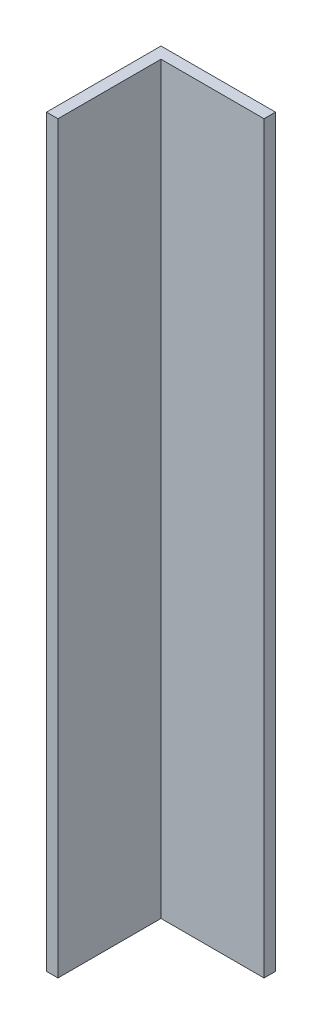
ISO-10303-21;
HEADER;
FILE_DESCRIPTION(('STEP AP214'),'2;1');
FILE_NAME('part.step','',(''),(''),'','','');
FILE_SCHEMA(('AUTOMOTIVE_DESIGN { 1 0 10303 214 1 1 1 1 }'));
ENDSEC;
DATA;
#1=APPLICATION_CONTEXT('core data for automotive mechanical design processes');
#2=APPLICATION_PROTOCOL_DEFINITION('international standard','automotive_design',2000,#1);
#3=PRODUCT_CONTEXT('',#1,'mechanical');
#4=PRODUCT('Part','Part','',(#3));
#5=PRODUCT_RELATED_PRODUCT_CATEGORY('part','',(#4));
#6=PRODUCT_DEFINITION_FORMATION('','',#4);
#7=PRODUCT_DEFINITION_CONTEXT('part definition',#1,'design');
#8=PRODUCT_DEFINITION('design','',#6,#7);
#9=PRODUCT_DEFINITION_SHAPE('','',#8);
#10=(LENGTH_UNIT() NAMED_UNIT(*) SI_UNIT(.MILLI.,.METRE.));
#11=(NAMED_UNIT(*) PLANE_ANGLE_UNIT() SI_UNIT($,.RADIAN.));
#12=(NAMED_UNIT(*) SI_UNIT($,.STERADIAN.) SOLID_ANGLE_UNIT());
#13=UNCERTAINTY_MEASURE_WITH_UNIT(LENGTH_MEASURE(1.E-05),#10,'distance_accuracy_value','');
#14=(GEOMETRIC_REPRESENTATION_CONTEXT(3) GLOBAL_UNCERTAINTY_ASSIGNED_CONTEXT((#13)) GLOBAL_UNIT_ASSIGNED_CONTEXT((#10,
#11,#12)) REPRESENTATION_CONTEXT('',''));
#15=CARTESIAN_POINT('',(0.,0.,0.));
#16=DIRECTION('',(0.,0.,1.));
#17=DIRECTION('',(1.,0.,0.));
#18=AXIS2_PLACEMENT_3D('',#15,#16,#17);
#19=CARTESIAN_POINT('',(0.,-130.,4.));
#20=DIRECTION('',(0.,1.,0.));
#21=DIRECTION('',(0.,0.,1.));
#22=AXIS2_PLACEMENT_3D('',#19,#20,#21);
#23=PLANE('',#22);
#24=DIRECTION('',(1.,0.,0.));
#25=VECTOR('',#24,1.);
#26=CARTESIAN_POINT('',(0.,-130.,0.));
#27=LINE('',#26,#25);
#28=CARTESIAN_POINT('',(-20.,-130.,0.));
#29=VERTEX_POINT('',#28);
#30=CARTESIAN_POINT('',(20.,-130.,0.));
#31=VERTEX_POINT('',#30);
#32=EDGE_CURVE('E93',#29,#31,#27,.T.);
#33=ORIENTED_EDGE('',*,*,#32,.T.);
#34=DIRECTION('',(0.,0.,-1.));
#35=VECTOR('',#34,1.);
#36=CARTESIAN_POINT('',(20.,-130.,4.));
#37=LINE('',#36,#35);
#38=CARTESIAN_POINT('',(20.,-130.,4.));
#39=VERTEX_POINT('',#38);
#40=EDGE_CURVE('E11',#39,#31,#37,.T.);
#41=ORIENTED_EDGE('',*,*,#40,.F.);
#42=DIRECTION('',(1.,0.,0.));
#43=VECTOR('',#42,1.);
#44=CARTESIAN_POINT('',(0.,-130.,4.));
#45=LINE('',#44,#43);
#46=CARTESIAN_POINT('',(-16.,-130.,4.));
#47=VERTEX_POINT('',#46);
#48=EDGE_CURVE('E53',#47,#39,#45,.T.);
#49=ORIENTED_EDGE('',*,*,#48,.F.);
#50=DIRECTION('',(0.,0.,-1.));
#51=VECTOR('',#50,1.);
#52=CARTESIAN_POINT('',(-16.,-130.,40.));
#53=LINE('',#52,#51);
#54=CARTESIAN_POINT('',(-16.,-130.,40.));
#55=VERTEX_POINT('',#54);
#56=EDGE_CURVE('E124',#55,#47,#53,.T.);
#57=ORIENTED_EDGE('',*,*,#56,.F.);
#58=DIRECTION('',(1.,0.,0.));
#59=VECTOR('',#58,1.);
#60=CARTESIAN_POINT('',(0.,-130.,40.));
#61=LINE('',#60,#59);
#62=CARTESIAN_POINT('',(-20.,-130.,40.));
#63=VERTEX_POINT('',#62);
#64=EDGE_CURVE('E128',#63,#55,#61,.T.);
#65=ORIENTED_EDGE('',*,*,#64,.F.);
#66=DIRECTION('',(0.,0.,-1.));
#67=VECTOR('',#66,1.);
#68=CARTESIAN_POINT('',(-20.,-130.,40.));
#69=LINE('',#68,#67);
#70=EDGE_CURVE('E96',#63,#29,#69,.T.);
#71=ORIENTED_EDGE('',*,*,#70,.T.);
#72=EDGE_LOOP('',(#33,#41,#49,#57,#65,#71));
#73=FACE_BOUND('',#72,.T.);
#74=ADVANCED_FACE('F35',(#73),#23,.F.);
#75=CARTESIAN_POINT('',(20.,0.,4.));
#76=DIRECTION('',(-1.,0.,0.));
#77=DIRECTION('',(0.,0.,1.));
#78=AXIS2_PLACEMENT_3D('',#75,#76,#77);
#79=PLANE('',#78);
#80=DIRECTION('',(0.,1.,0.));
#81=VECTOR('',#80,1.);
#82=CARTESIAN_POINT('',(20.,0.,0.));
#83=LINE('',#82,#81);
#84=CARTESIAN_POINT('',(20.,130.,0.));
#85=VERTEX_POINT('',#84);
#86=EDGE_CURVE('E66',#31,#85,#83,.T.);
#87=ORIENTED_EDGE('',*,*,#86,.T.);
#88=DIRECTION('',(0.,0.,-1.));
#89=VECTOR('',#88,1.);
#90=CARTESIAN_POINT('',(20.,130.,4.));
#91=LINE('',#90,#89);
#92=CARTESIAN_POINT('',(20.,130.,4.));
#93=VERTEX_POINT('',#92);
#94=EDGE_CURVE('E44',#93,#85,#91,.T.);
#95=ORIENTED_EDGE('',*,*,#94,.F.);
#96=DIRECTION('',(0.,1.,0.));
#97=VECTOR('',#96,1.);
#98=CARTESIAN_POINT('',(20.,0.,4.));
#99=LINE('',#98,#97);
#100=EDGE_CURVE('E84',#39,#93,#99,.T.);
#101=ORIENTED_EDGE('',*,*,#100,.F.);
#102=ORIENTED_EDGE('',*,*,#40,.T.);
#103=EDGE_LOOP('',(#87,#95,#101,#102));
#104=FACE_BOUND('',#103,.T.);
#105=ADVANCED_FACE('F85',(#104),#79,.F.);
#106=CARTESIAN_POINT('',(0.,130.,4.));
#107=DIRECTION('',(0.,1.,0.));
#108=DIRECTION('',(0.,0.,1.));
#109=AXIS2_PLACEMENT_3D('',#106,#107,#108);
#110=PLANE('',#109);
#111=DIRECTION('',(1.,0.,0.));
#112=VECTOR('',#111,1.);
#113=CARTESIAN_POINT('',(0.,130.,0.));
#114=LINE('',#113,#112);
#115=CARTESIAN_POINT('',(-20.,130.,0.));
#116=VERTEX_POINT('',#115);
#117=EDGE_CURVE('E91',#116,#85,#114,.T.);
#118=ORIENTED_EDGE('',*,*,#117,.F.);
#119=DIRECTION('',(0.,0.,-1.));
#120=VECTOR('',#119,1.);
#121=CARTESIAN_POINT('',(-20.,130.,40.));
#122=LINE('',#121,#120);
#123=CARTESIAN_POINT('',(-20.,130.,40.));
#124=VERTEX_POINT('',#123);
#125=EDGE_CURVE('E99',#124,#116,#122,.T.);
#126=ORIENTED_EDGE('',*,*,#125,.F.);
#127=DIRECTION('',(1.,0.,0.));
#128=VECTOR('',#127,1.);
#129=CARTESIAN_POINT('',(0.,130.,40.));
#130=LINE('',#129,#128);
#131=CARTESIAN_POINT('',(-16.,130.,40.));
#132=VERTEX_POINT('',#131);
#133=EDGE_CURVE('E121',#124,#132,#130,.T.);
#134=ORIENTED_EDGE('',*,*,#133,.T.);
#135=DIRECTION('',(0.,0.,-1.));
#136=VECTOR('',#135,1.);
#137=CARTESIAN_POINT('',(-16.,130.,40.));
#138=LINE('',#137,#136);
#139=CARTESIAN_POINT('',(-16.,130.,4.));
#140=VERTEX_POINT('',#139);
#141=EDGE_CURVE('E118',#132,#140,#138,.T.);
#142=ORIENTED_EDGE('',*,*,#141,.T.);
#143=DIRECTION('',(1.,0.,0.));
#144=VECTOR('',#143,1.);
#145=CARTESIAN_POINT('',(0.,130.,4.));
#146=LINE('',#145,#144);
#147=EDGE_CURVE('E73',#140,#93,#146,.T.);
#148=ORIENTED_EDGE('',*,*,#147,.T.);
#149=ORIENTED_EDGE('',*,*,#94,.T.);
#150=EDGE_LOOP('',(#118,#126,#134,#142,#148,#149));
#151=FACE_BOUND('',#150,.T.);
#152=ADVANCED_FACE('F115',(#151),#110,.T.);
#153=CARTESIAN_POINT('',(0.,0.,4.));
#154=DIRECTION('',(0.,0.,1.));
#155=DIRECTION('',(1.,0.,0.));
#156=AXIS2_PLACEMENT_3D('',#153,#154,#155);
#157=PLANE('',#156);
#158=ORIENTED_EDGE('',*,*,#48,.T.);
#159=ORIENTED_EDGE('',*,*,#100,.T.);
#160=ORIENTED_EDGE('',*,*,#147,.F.);
#161=DIRECTION('',(0.,1.,0.));
#162=VECTOR('',#161,1.);
#163=CARTESIAN_POINT('',(-16.,0.,4.));
#164=LINE('',#163,#162);
#165=EDGE_CURVE('E89',#47,#140,#164,.T.);
#166=ORIENTED_EDGE('',*,*,#165,.F.);
#167=EDGE_LOOP('',(#158,#159,#160,#166));
#168=FACE_BOUND('',#167,.T.);
#169=ADVANCED_FACE('F88',(#168),#157,.T.);
#170=CARTESIAN_POINT('',(0.,0.,0.));
#171=DIRECTION('',(0.,0.,1.));
#172=DIRECTION('',(1.,0.,0.));
#173=AXIS2_PLACEMENT_3D('',#170,#171,#172);
#174=PLANE('',#173);
#175=ORIENTED_EDGE('',*,*,#32,.F.);
#176=DIRECTION('',(0.,1.,0.));
#177=VECTOR('',#176,1.);
#178=CARTESIAN_POINT('',(-20.,0.,0.));
#179=LINE('',#178,#177);
#180=EDGE_CURVE('E135',#29,#116,#179,.T.);
#181=ORIENTED_EDGE('',*,*,#180,.T.);
#182=ORIENTED_EDGE('',*,*,#117,.T.);
#183=ORIENTED_EDGE('',*,*,#86,.F.);
#184=EDGE_LOOP('',(#175,#181,#182,#183));
#185=FACE_BOUND('',#184,.T.);
#186=ADVANCED_FACE('F154',(#185),#174,.F.);
#187=CARTESIAN_POINT('',(-16.,0.,40.));
#188=DIRECTION('',(-1.,0.,0.));
#189=DIRECTION('',(0.,0.,1.));
#190=AXIS2_PLACEMENT_3D('',#187,#188,#189);
#191=PLANE('',#190);
#192=ORIENTED_EDGE('',*,*,#56,.T.);
#193=ORIENTED_EDGE('',*,*,#165,.T.);
#194=ORIENTED_EDGE('',*,*,#141,.F.);
#195=DIRECTION('',(0.,1.,0.));
#196=VECTOR('',#195,1.);
#197=CARTESIAN_POINT('',(-16.,0.,40.));
#198=LINE('',#197,#196);
#199=EDGE_CURVE('E125',#55,#132,#198,.T.);
#200=ORIENTED_EDGE('',*,*,#199,.F.);
#201=EDGE_LOOP('',(#192,#193,#194,#200));
#202=FACE_BOUND('',#201,.T.);
#203=ADVANCED_FACE('F156',(#202),#191,.F.);
#204=CARTESIAN_POINT('',(-20.,0.,40.));
#205=DIRECTION('',(-1.,0.,0.));
#206=DIRECTION('',(0.,0.,1.));
#207=AXIS2_PLACEMENT_3D('',#204,#205,#206);
#208=PLANE('',#207);
#209=ORIENTED_EDGE('',*,*,#180,.F.);
#210=ORIENTED_EDGE('',*,*,#70,.F.);
#211=DIRECTION('',(0.,1.,0.));
#212=VECTOR('',#211,1.);
#213=CARTESIAN_POINT('',(-20.,0.,40.));
#214=LINE('',#213,#212);
#215=EDGE_CURVE('E140',#63,#124,#214,.T.);
#216=ORIENTED_EDGE('',*,*,#215,.T.);
#217=ORIENTED_EDGE('',*,*,#125,.T.);
#218=EDGE_LOOP('',(#209,#210,#216,#217));
#219=FACE_BOUND('',#218,.T.);
#220=ADVANCED_FACE('F146',(#219),#208,.T.);
#221=CARTESIAN_POINT('',(0.,0.,40.));
#222=DIRECTION('',(0.,0.,1.));
#223=DIRECTION('',(1.,0.,0.));
#224=AXIS2_PLACEMENT_3D('',#221,#222,#223);
#225=PLANE('',#224);
#226=ORIENTED_EDGE('',*,*,#133,.F.);
#227=ORIENTED_EDGE('',*,*,#215,.F.);
#228=ORIENTED_EDGE('',*,*,#64,.T.);
#229=ORIENTED_EDGE('',*,*,#199,.T.);
#230=EDGE_LOOP('',(#226,#227,#228,#229));
#231=FACE_BOUND('',#230,.T.);
#232=ADVANCED_FACE('F151',(#231),#225,.T.);
#233=CLOSED_SHELL('',(#74,#105,#152,#169,#186,#203,#220,#232));
#234=MANIFOLD_SOLID_BREP('B2',#233);
#235=ADVANCED_BREP_SHAPE_REPRESENTATION('',(#18,#234),#14);
#236=SHAPE_DEFINITION_REPRESENTATION(#9,#235);
ENDSEC;
END-ISO-10303-21;
